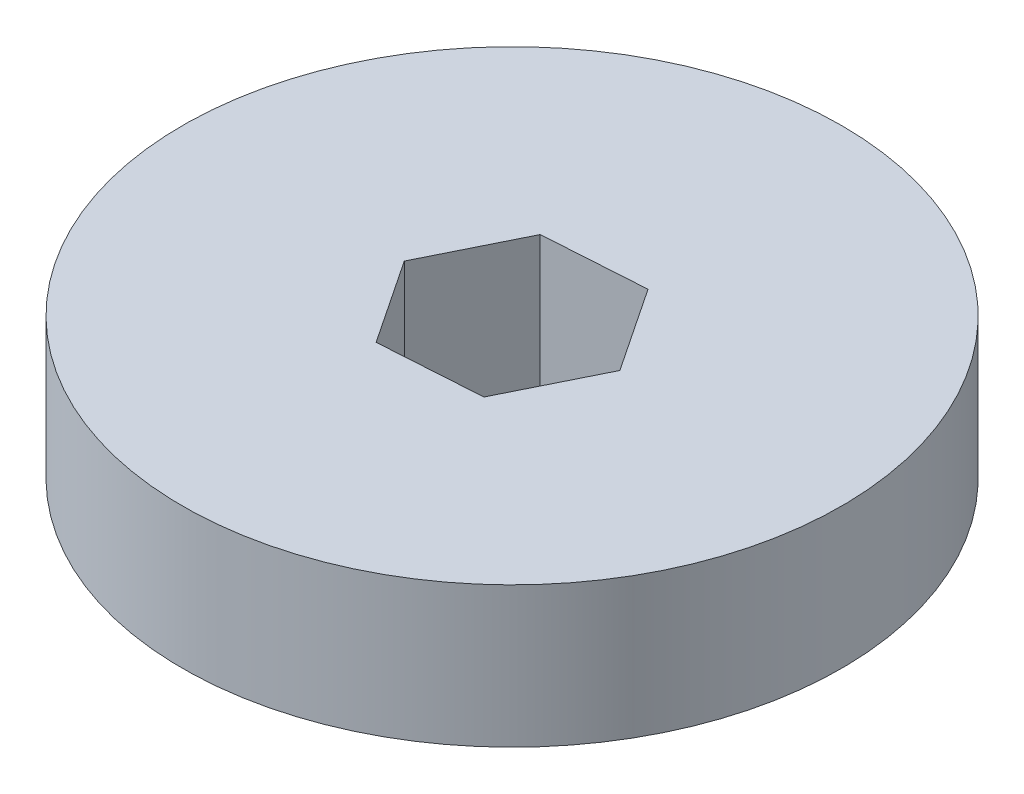
ISO-10303-21;
HEADER;
FILE_DESCRIPTION(('STEP AP214'),'2;1');
FILE_NAME('part.step','',(''),(''),'','','');
FILE_SCHEMA(('AUTOMOTIVE_DESIGN { 1 0 10303 214 1 1 1 1 }'));
ENDSEC;
DATA;
#1=APPLICATION_CONTEXT('core data for automotive mechanical design processes');
#2=APPLICATION_PROTOCOL_DEFINITION('international standard','automotive_design',2000,#1);
#3=PRODUCT_CONTEXT('',#1,'mechanical');
#4=PRODUCT('Part','Part','',(#3));
#5=PRODUCT_RELATED_PRODUCT_CATEGORY('part','',(#4));
#6=PRODUCT_DEFINITION_FORMATION('','',#4);
#7=PRODUCT_DEFINITION_CONTEXT('part definition',#1,'design');
#8=PRODUCT_DEFINITION('design','',#6,#7);
#9=PRODUCT_DEFINITION_SHAPE('','',#8);
#10=(LENGTH_UNIT() NAMED_UNIT(*) SI_UNIT(.MILLI.,.METRE.));
#11=(NAMED_UNIT(*) PLANE_ANGLE_UNIT() SI_UNIT($,.RADIAN.));
#12=(NAMED_UNIT(*) SI_UNIT($,.STERADIAN.) SOLID_ANGLE_UNIT());
#13=UNCERTAINTY_MEASURE_WITH_UNIT(LENGTH_MEASURE(1.E-05),#10,'distance_accuracy_value','');
#14=(GEOMETRIC_REPRESENTATION_CONTEXT(3) GLOBAL_UNCERTAINTY_ASSIGNED_CONTEXT((#13)) GLOBAL_UNIT_ASSIGNED_CONTEXT((#10,
#11,#12)) REPRESENTATION_CONTEXT('',''));
#15=CARTESIAN_POINT('',(0.,0.,0.));
#16=DIRECTION('',(0.,0.,1.));
#17=DIRECTION('',(1.,0.,0.));
#18=AXIS2_PLACEMENT_3D('',#15,#16,#17);
#19=CARTESIAN_POINT('',(0.,10.16,0.));
#20=DIRECTION('',(0.,1.,0.));
#21=DIRECTION('',(0.,0.,1.));
#22=AXIS2_PLACEMENT_3D('',#19,#20,#21);
#23=PLANE('',#22);
#24=DIRECTION('',(0.997926790235506,0.,-0.0643593142463527));
#25=VECTOR('',#24,1.);
#26=CARTESIAN_POINT('',(-3.24989181572061,10.16,6.57278757601716));
#27=LINE('',#26,#25);
#28=CARTESIAN_POINT('',(-3.24989181572061,10.16,6.57278757601716));
#29=VERTEX_POINT('',#28);
#30=CARTESIAN_POINT('',(4.06725510664929,10.16,6.10088265997376));
#31=VERTEX_POINT('',#30);
#32=EDGE_CURVE('E49',#29,#31,#27,.T.);
#33=ORIENTED_EDGE('',*,*,#32,.F.);
#34=DIRECTION('',(0.55470019622524,0.,0.832050294337836));
#35=VECTOR('',#34,1.);
#36=CARTESIAN_POINT('',(-7.31714692236991,10.16,0.471904916043393));
#37=LINE('',#36,#35);
#38=CARTESIAN_POINT('',(-7.31714692236991,10.16,0.471904916043393));
#39=VERTEX_POINT('',#38);
#40=EDGE_CURVE('E103',#39,#29,#37,.T.);
#41=ORIENTED_EDGE('',*,*,#40,.F.);
#42=DIRECTION('',(-0.443226594010266,0.,0.896409608584189));
#43=VECTOR('',#42,1.);
#44=CARTESIAN_POINT('',(-4.06725510664929,10.16,-6.10088265997377));
#45=LINE('',#44,#43);
#46=CARTESIAN_POINT('',(-4.06725510664929,10.16,-6.10088265997377));
#47=VERTEX_POINT('',#46);
#48=EDGE_CURVE('E106',#47,#39,#45,.T.);
#49=ORIENTED_EDGE('',*,*,#48,.F.);
#50=DIRECTION('',(-0.997926790235506,0.,0.0643593142463525));
#51=VECTOR('',#50,1.);
#52=CARTESIAN_POINT('',(3.24989181572061,10.16,-6.57278757601716));
#53=LINE('',#52,#51);
#54=CARTESIAN_POINT('',(3.24989181572061,10.16,-6.57278757601716));
#55=VERTEX_POINT('',#54);
#56=EDGE_CURVE('E126',#55,#47,#53,.T.);
#57=ORIENTED_EDGE('',*,*,#56,.F.);
#58=DIRECTION('',(-0.55470019622524,0.,-0.832050294337836));
#59=VECTOR('',#58,1.);
#60=CARTESIAN_POINT('',(7.31714692236991,10.16,-0.471904916043392));
#61=LINE('',#60,#59);
#62=CARTESIAN_POINT('',(7.31714692236991,10.16,-0.471904916043392));
#63=VERTEX_POINT('',#62);
#64=EDGE_CURVE('E123',#63,#55,#61,.T.);
#65=ORIENTED_EDGE('',*,*,#64,.F.);
#66=DIRECTION('',(0.443226594010266,0.,-0.896409608584189));
#67=VECTOR('',#66,1.);
#68=CARTESIAN_POINT('',(4.06725510664929,10.16,6.10088265997377));
#69=LINE('',#68,#67);
#70=EDGE_CURVE('E120',#31,#63,#69,.T.);
#71=ORIENTED_EDGE('',*,*,#70,.F.);
#72=EDGE_LOOP('',(#33,#41,#49,#57,#65,#71));
#73=FACE_BOUND('',#72,.T.);
#74=CARTESIAN_POINT('',(0.,10.16,0.));
#75=DIRECTION('',(0.,-1.,0.));
#76=DIRECTION('',(0.,0.,-1.));
#77=AXIS2_PLACEMENT_3D('',#74,#75,#76);
#78=CIRCLE('',#77,23.8125);
#79=CARTESIAN_POINT('',(0.,10.16,-23.8125));
#80=VERTEX_POINT('',#79);
#81=EDGE_CURVE('E121',#80,#80,#78,.T.);
#82=ORIENTED_EDGE('',*,*,#81,.F.);
#83=EDGE_LOOP('',(#82));
#84=FACE_BOUND('',#83,.T.);
#85=ADVANCED_FACE('F33',(#73,#84),#23,.T.);
#86=CARTESIAN_POINT('',(0.,0.,0.));
#87=DIRECTION('',(0.,1.,0.));
#88=DIRECTION('',(0.,0.,1.));
#89=AXIS2_PLACEMENT_3D('',#86,#87,#88);
#90=PLANE('',#89);
#91=DIRECTION('',(0.55470019622524,0.,0.832050294337836));
#92=VECTOR('',#91,1.);
#93=CARTESIAN_POINT('',(-7.31714692236991,0.,0.471904916043393));
#94=LINE('',#93,#92);
#95=CARTESIAN_POINT('',(-7.31714692236991,0.,0.471904916043393));
#96=VERTEX_POINT('',#95);
#97=CARTESIAN_POINT('',(-3.24989181572061,0.,6.57278757601716));
#98=VERTEX_POINT('',#97);
#99=EDGE_CURVE('E94',#96,#98,#94,.T.);
#100=ORIENTED_EDGE('',*,*,#99,.T.);
#101=DIRECTION('',(0.997926790235506,0.,-0.0643593142463527));
#102=VECTOR('',#101,1.);
#103=CARTESIAN_POINT('',(-3.24989181572061,0.,6.57278757601716));
#104=LINE('',#103,#102);
#105=CARTESIAN_POINT('',(4.06725510664929,0.,6.10088265997377));
#106=VERTEX_POINT('',#105);
#107=EDGE_CURVE('E88',#98,#106,#104,.T.);
#108=ORIENTED_EDGE('',*,*,#107,.T.);
#109=DIRECTION('',(0.443226594010266,0.,-0.896409608584189));
#110=VECTOR('',#109,1.);
#111=CARTESIAN_POINT('',(4.06725510664929,0.,6.10088265997377));
#112=LINE('',#111,#110);
#113=CARTESIAN_POINT('',(7.31714692236991,0.,-0.471904916043391));
#114=VERTEX_POINT('',#113);
#115=EDGE_CURVE('E96',#106,#114,#112,.T.);
#116=ORIENTED_EDGE('',*,*,#115,.T.);
#117=DIRECTION('',(-0.55470019622524,0.,-0.832050294337836));
#118=VECTOR('',#117,1.);
#119=CARTESIAN_POINT('',(7.31714692236991,0.,-0.471904916043392));
#120=LINE('',#119,#118);
#121=CARTESIAN_POINT('',(3.24989181572061,0.,-6.57278757601716));
#122=VERTEX_POINT('',#121);
#123=EDGE_CURVE('E57',#114,#122,#120,.T.);
#124=ORIENTED_EDGE('',*,*,#123,.T.);
#125=DIRECTION('',(-0.997926790235506,0.,0.0643593142463525));
#126=VECTOR('',#125,1.);
#127=CARTESIAN_POINT('',(3.24989181572061,0.,-6.57278757601716));
#128=LINE('',#127,#126);
#129=CARTESIAN_POINT('',(-4.06725510664929,0.,-6.10088265997377));
#130=VERTEX_POINT('',#129);
#131=EDGE_CURVE('E113',#122,#130,#128,.T.);
#132=ORIENTED_EDGE('',*,*,#131,.T.);
#133=DIRECTION('',(-0.443226594010266,0.,0.896409608584189));
#134=VECTOR('',#133,1.);
#135=CARTESIAN_POINT('',(-4.06725510664929,0.,-6.10088265997377));
#136=LINE('',#135,#134);
#137=EDGE_CURVE('E116',#130,#96,#136,.T.);
#138=ORIENTED_EDGE('',*,*,#137,.T.);
#139=EDGE_LOOP('',(#100,#108,#116,#124,#132,#138));
#140=FACE_BOUND('',#139,.T.);
#141=CARTESIAN_POINT('',(0.,0.,0.));
#142=DIRECTION('',(0.,-1.,0.));
#143=DIRECTION('',(0.,0.,-1.));
#144=AXIS2_PLACEMENT_3D('',#141,#142,#143);
#145=CIRCLE('',#144,23.8125);
#146=CARTESIAN_POINT('',(0.,0.,-23.8125));
#147=VERTEX_POINT('',#146);
#148=EDGE_CURVE('E109',#147,#147,#145,.T.);
#149=ORIENTED_EDGE('',*,*,#148,.T.);
#150=EDGE_LOOP('',(#149));
#151=FACE_BOUND('',#150,.T.);
#152=ADVANCED_FACE('F35',(#140,#151),#90,.F.);
#153=CARTESIAN_POINT('',(-3.24989181572061,0.,6.57278757601716));
#154=DIRECTION('',(0.0643593142463528,0.,0.997926790235506));
#155=DIRECTION('',(0.997926790235506,0.,-0.0643593142463528));
#156=AXIS2_PLACEMENT_3D('',#153,#154,#155);
#157=PLANE('',#156);
#158=ORIENTED_EDGE('',*,*,#32,.T.);
#159=DIRECTION('',(0.,1.,0.));
#160=VECTOR('',#159,1.);
#161=CARTESIAN_POINT('',(4.06725510664929,0.,6.10088265997377));
#162=LINE('',#161,#160);
#163=EDGE_CURVE('E37',#106,#31,#162,.T.);
#164=ORIENTED_EDGE('',*,*,#163,.F.);
#165=ORIENTED_EDGE('',*,*,#107,.F.);
#166=DIRECTION('',(0.,1.,0.));
#167=VECTOR('',#166,1.);
#168=CARTESIAN_POINT('',(-3.24989181572061,0.,6.57278757601716));
#169=LINE('',#168,#167);
#170=EDGE_CURVE('E11',#98,#29,#169,.T.);
#171=ORIENTED_EDGE('',*,*,#170,.T.);
#172=EDGE_LOOP('',(#158,#164,#165,#171));
#173=FACE_BOUND('',#172,.T.);
#174=ADVANCED_FACE('F86',(#173),#157,.F.);
#175=CARTESIAN_POINT('',(-7.31714692236991,0.,0.471904916043393));
#176=DIRECTION('',(-0.832050294337837,0.,0.55470019622524));
#177=DIRECTION('',(0.55470019622524,0.,0.832050294337837));
#178=AXIS2_PLACEMENT_3D('',#175,#176,#177);
#179=PLANE('',#178);
#180=ORIENTED_EDGE('',*,*,#40,.T.);
#181=ORIENTED_EDGE('',*,*,#170,.F.);
#182=ORIENTED_EDGE('',*,*,#99,.F.);
#183=DIRECTION('',(0.,1.,0.));
#184=VECTOR('',#183,1.);
#185=CARTESIAN_POINT('',(-7.31714692236991,0.,0.471904916043393));
#186=LINE('',#185,#184);
#187=EDGE_CURVE('E42',#96,#39,#186,.T.);
#188=ORIENTED_EDGE('',*,*,#187,.T.);
#189=EDGE_LOOP('',(#180,#181,#182,#188));
#190=FACE_BOUND('',#189,.T.);
#191=ADVANCED_FACE('F149',(#190),#179,.F.);
#192=CARTESIAN_POINT('',(-4.06725510664929,0.,-6.10088265997377));
#193=DIRECTION('',(-0.896409608584189,0.,-0.443226594010266));
#194=DIRECTION('',(-0.443226594010266,0.,0.896409608584189));
#195=AXIS2_PLACEMENT_3D('',#192,#193,#194);
#196=PLANE('',#195);
#197=ORIENTED_EDGE('',*,*,#48,.T.);
#198=ORIENTED_EDGE('',*,*,#187,.F.);
#199=ORIENTED_EDGE('',*,*,#137,.F.);
#200=DIRECTION('',(0.,1.,0.));
#201=VECTOR('',#200,1.);
#202=CARTESIAN_POINT('',(-4.06725510664929,0.,-6.10088265997377));
#203=LINE('',#202,#201);
#204=EDGE_CURVE('E132',#130,#47,#203,.T.);
#205=ORIENTED_EDGE('',*,*,#204,.T.);
#206=EDGE_LOOP('',(#197,#198,#199,#205));
#207=FACE_BOUND('',#206,.T.);
#208=ADVANCED_FACE('F147',(#207),#196,.F.);
#209=CARTESIAN_POINT('',(3.24989181572061,0.,-6.57278757601716));
#210=DIRECTION('',(-0.0643593142463525,0.,-0.997926790235506));
#211=DIRECTION('',(-0.997926790235506,0.,0.0643593142463525));
#212=AXIS2_PLACEMENT_3D('',#209,#210,#211);
#213=PLANE('',#212);
#214=ORIENTED_EDGE('',*,*,#56,.T.);
#215=ORIENTED_EDGE('',*,*,#204,.F.);
#216=ORIENTED_EDGE('',*,*,#131,.F.);
#217=DIRECTION('',(0.,1.,0.));
#218=VECTOR('',#217,1.);
#219=CARTESIAN_POINT('',(3.24989181572061,0.,-6.57278757601716));
#220=LINE('',#219,#218);
#221=EDGE_CURVE('E134',#122,#55,#220,.T.);
#222=ORIENTED_EDGE('',*,*,#221,.T.);
#223=EDGE_LOOP('',(#214,#215,#216,#222));
#224=FACE_BOUND('',#223,.T.);
#225=ADVANCED_FACE('F143',(#224),#213,.F.);
#226=CARTESIAN_POINT('',(7.31714692236991,0.,-0.471904916043392));
#227=DIRECTION('',(0.832050294337836,0.,-0.55470019622524));
#228=DIRECTION('',(-0.55470019622524,0.,-0.832050294337837));
#229=AXIS2_PLACEMENT_3D('',#226,#227,#228);
#230=PLANE('',#229);
#231=ORIENTED_EDGE('',*,*,#64,.T.);
#232=ORIENTED_EDGE('',*,*,#221,.F.);
#233=ORIENTED_EDGE('',*,*,#123,.F.);
#234=DIRECTION('',(0.,1.,0.));
#235=VECTOR('',#234,1.);
#236=CARTESIAN_POINT('',(7.31714692236991,0.,-0.471904916043392));
#237=LINE('',#236,#235);
#238=EDGE_CURVE('E93',#114,#63,#237,.T.);
#239=ORIENTED_EDGE('',*,*,#238,.T.);
#240=EDGE_LOOP('',(#231,#232,#233,#239));
#241=FACE_BOUND('',#240,.T.);
#242=ADVANCED_FACE('F135',(#241),#230,.F.);
#243=CARTESIAN_POINT('',(4.06725510664929,0.,6.10088265997377));
#244=DIRECTION('',(0.896409608584189,0.,0.443226594010266));
#245=DIRECTION('',(0.443226594010266,0.,-0.896409608584189));
#246=AXIS2_PLACEMENT_3D('',#243,#244,#245);
#247=PLANE('',#246);
#248=ORIENTED_EDGE('',*,*,#70,.T.);
#249=ORIENTED_EDGE('',*,*,#238,.F.);
#250=ORIENTED_EDGE('',*,*,#115,.F.);
#251=ORIENTED_EDGE('',*,*,#163,.T.);
#252=EDGE_LOOP('',(#248,#249,#250,#251));
#253=FACE_BOUND('',#252,.T.);
#254=ADVANCED_FACE('F97',(#253),#247,.F.);
#255=CARTESIAN_POINT('',(0.,10.16,0.));
#256=DIRECTION('',(0.,-1.,0.));
#257=DIRECTION('',(0.,0.,-1.));
#258=AXIS2_PLACEMENT_3D('',#255,#256,#257);
#259=CYLINDRICAL_SURFACE('',#258,23.8125);
#260=ORIENTED_EDGE('',*,*,#81,.T.);
#261=EDGE_LOOP('',(#260));
#262=FACE_BOUND('',#261,.T.);
#263=ORIENTED_EDGE('',*,*,#148,.F.);
#264=EDGE_LOOP('',(#263));
#265=FACE_BOUND('',#264,.T.);
#266=ADVANCED_FACE('F166',(#262,#265),#259,.T.);
#267=CLOSED_SHELL('',(#85,#152,#174,#191,#208,#225,#242,#254,#266));
#268=MANIFOLD_SOLID_BREP('B2',#267);
#269=ADVANCED_BREP_SHAPE_REPRESENTATION('',(#18,#268),#14);
#270=SHAPE_DEFINITION_REPRESENTATION(#9,#269);
ENDSEC;
END-ISO-10303-21;
